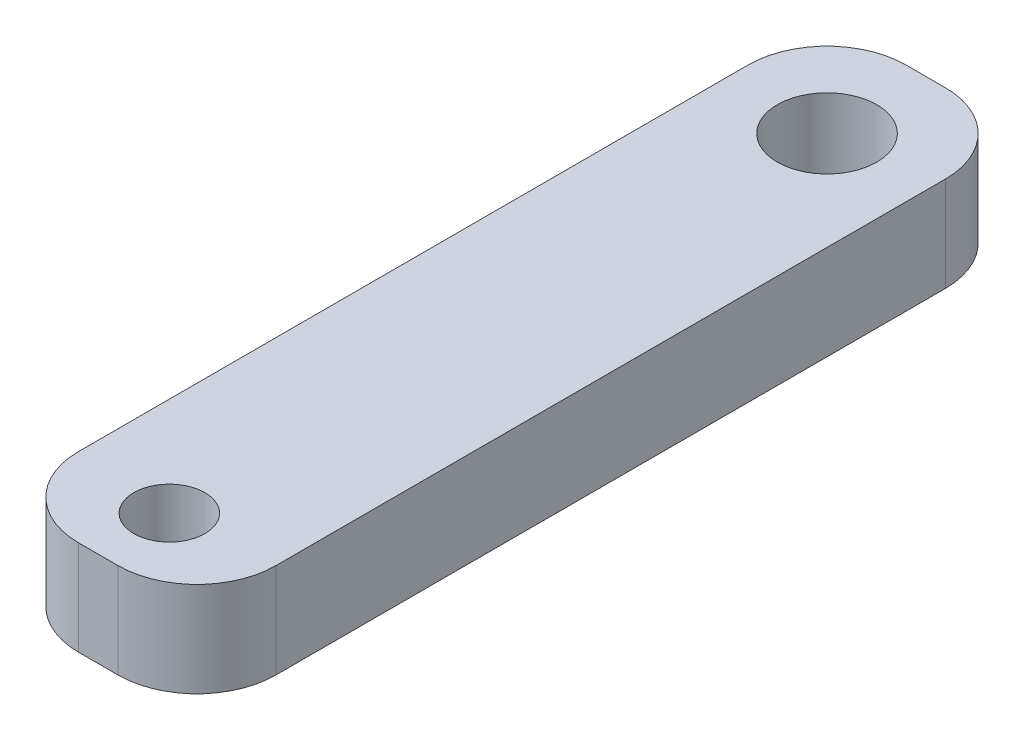
ISO-10303-21;
HEADER;
FILE_DESCRIPTION(('STEP AP214'),'2;1');
FILE_NAME('part.step','',(''),(''),'','','');
FILE_SCHEMA(('AUTOMOTIVE_DESIGN { 1 0 10303 214 1 1 1 1 }'));
ENDSEC;
DATA;
#1=APPLICATION_CONTEXT('core data for automotive mechanical design processes');
#2=APPLICATION_PROTOCOL_DEFINITION('international standard','automotive_design',2000,#1);
#3=PRODUCT_CONTEXT('',#1,'mechanical');
#4=PRODUCT('Part','Part','',(#3));
#5=PRODUCT_RELATED_PRODUCT_CATEGORY('part','',(#4));
#6=PRODUCT_DEFINITION_FORMATION('','',#4);
#7=PRODUCT_DEFINITION_CONTEXT('part definition',#1,'design');
#8=PRODUCT_DEFINITION('design','',#6,#7);
#9=PRODUCT_DEFINITION_SHAPE('','',#8);
#10=(LENGTH_UNIT() NAMED_UNIT(*) SI_UNIT(.MILLI.,.METRE.));
#11=(NAMED_UNIT(*) PLANE_ANGLE_UNIT() SI_UNIT($,.RADIAN.));
#12=(NAMED_UNIT(*) SI_UNIT($,.STERADIAN.) SOLID_ANGLE_UNIT());
#13=UNCERTAINTY_MEASURE_WITH_UNIT(LENGTH_MEASURE(1.E-05),#10,'distance_accuracy_value','');
#14=(GEOMETRIC_REPRESENTATION_CONTEXT(3) GLOBAL_UNCERTAINTY_ASSIGNED_CONTEXT((#13)) GLOBAL_UNIT_ASSIGNED_CONTEXT((#10,
#11,#12)) REPRESENTATION_CONTEXT('',''));
#15=CARTESIAN_POINT('',(0.,0.,0.));
#16=DIRECTION('',(0.,0.,1.));
#17=DIRECTION('',(1.,0.,0.));
#18=AXIS2_PLACEMENT_3D('',#15,#16,#17);
#19=CARTESIAN_POINT('',(143.707898145163,84.0030258628715,176.598461023065));
#20=DIRECTION('',(0.,1.,0.));
#21=DIRECTION('',(0.,0.,1.));
#22=AXIS2_PLACEMENT_3D('',#19,#20,#21);
#23=PLANE('',#22);
#24=CARTESIAN_POINT('',(143.072898145163,84.0030258628715,155.70030058551));
#25=DIRECTION('',(0.,1.,0.));
#26=DIRECTION('',(0.,0.,1.));
#27=AXIS2_PLACEMENT_3D('',#24,#25,#26);
#28=CIRCLE('',#27,1.59999999999999);
#29=CARTESIAN_POINT('',(143.072898145163,84.0030258628715,157.30030058551));
#30=VERTEX_POINT('',#29);
#31=EDGE_CURVE('E152',#30,#30,#28,.T.);
#32=ORIENTED_EDGE('',*,*,#31,.F.);
#33=EDGE_LOOP('',(#32));
#34=FACE_BOUND('',#33,.T.);
#35=CARTESIAN_POINT('',(143.707898145163,84.0030258628715,176.598461023065));
#36=DIRECTION('',(0.,1.,0.));
#37=DIRECTION('',(0.,0.,1.));
#38=AXIS2_PLACEMENT_3D('',#35,#36,#37);
#39=CIRCLE('',#38,2.53999999999999);
#40=CARTESIAN_POINT('',(143.707898145163,84.0030258628715,179.138461023065));
#41=VERTEX_POINT('',#40);
#42=CARTESIAN_POINT('',(146.247898145163,84.0030258628715,176.598461023065));
#43=VERTEX_POINT('',#42);
#44=EDGE_CURVE('E170',#41,#43,#39,.T.);
#45=ORIENTED_EDGE('',*,*,#44,.T.);
#46=DIRECTION('',(0.,0.,-1.));
#47=VECTOR('',#46,1.);
#48=CARTESIAN_POINT('',(146.247898145163,84.0030258628715,155.06530058551));
#49=LINE('',#48,#47);
#50=CARTESIAN_POINT('',(146.247898145163,84.0030258628715,155.06530058551));
#51=VERTEX_POINT('',#50);
#52=EDGE_CURVE('E106',#43,#51,#49,.T.);
#53=ORIENTED_EDGE('',*,*,#52,.T.);
#54=CARTESIAN_POINT('',(143.707898145163,84.0030258628715,155.06530058551));
#55=DIRECTION('',(0.,1.,0.));
#56=DIRECTION('',(0.,0.,-1.));
#57=AXIS2_PLACEMENT_3D('',#54,#55,#56);
#58=CIRCLE('',#57,2.53999999999999);
#59=CARTESIAN_POINT('',(143.707898145163,84.0030258628715,152.52530058551));
#60=VERTEX_POINT('',#59);
#61=EDGE_CURVE('E191',#51,#60,#58,.T.);
#62=ORIENTED_EDGE('',*,*,#61,.T.);
#63=DIRECTION('',(-1.,0.,0.));
#64=VECTOR('',#63,1.);
#65=CARTESIAN_POINT('',(142.437898145163,84.0030258628715,152.52530058551));
#66=LINE('',#65,#64);
#67=CARTESIAN_POINT('',(142.437898145163,84.0030258628715,152.52530058551));
#68=VERTEX_POINT('',#67);
#69=EDGE_CURVE('E205',#60,#68,#66,.T.);
#70=ORIENTED_EDGE('',*,*,#69,.T.);
#71=CARTESIAN_POINT('',(142.437898145163,84.0030258628715,155.06530058551));
#72=DIRECTION('',(0.,1.,0.));
#73=DIRECTION('',(0.,0.,1.));
#74=AXIS2_PLACEMENT_3D('',#71,#72,#73);
#75=CIRCLE('',#74,2.53999999999999);
#76=CARTESIAN_POINT('',(139.897898145163,84.0030258628715,155.06530058551));
#77=VERTEX_POINT('',#76);
#78=EDGE_CURVE('E125',#68,#77,#75,.T.);
#79=ORIENTED_EDGE('',*,*,#78,.T.);
#80=DIRECTION('',(0.,0.,1.));
#81=VECTOR('',#80,1.);
#82=CARTESIAN_POINT('',(139.897898145163,84.0030258628715,155.06530058551));
#83=LINE('',#82,#81);
#84=CARTESIAN_POINT('',(139.897898145163,84.0030258628715,176.598461023065));
#85=VERTEX_POINT('',#84);
#86=EDGE_CURVE('E119',#77,#85,#83,.T.);
#87=ORIENTED_EDGE('',*,*,#86,.T.);
#88=CARTESIAN_POINT('',(142.437898145163,84.0030258628715,176.598461023065));
#89=DIRECTION('',(0.,1.,0.));
#90=DIRECTION('',(0.,0.,1.));
#91=AXIS2_PLACEMENT_3D('',#88,#89,#90);
#92=CIRCLE('',#91,2.53999999999999);
#93=CARTESIAN_POINT('',(142.437898145163,84.0030258628715,179.138461023065));
#94=VERTEX_POINT('',#93);
#95=EDGE_CURVE('E123',#85,#94,#92,.T.);
#96=ORIENTED_EDGE('',*,*,#95,.T.);
#97=DIRECTION('',(1.,0.,0.));
#98=VECTOR('',#97,1.);
#99=CARTESIAN_POINT('',(142.437898145163,84.0030258628715,179.138461023065));
#100=LINE('',#99,#98);
#101=EDGE_CURVE('E63',#94,#41,#100,.T.);
#102=ORIENTED_EDGE('',*,*,#101,.T.);
#103=EDGE_LOOP('',(#45,#53,#62,#70,#79,#87,#96,#102));
#104=FACE_BOUND('',#103,.T.);
#105=CARTESIAN_POINT('',(143.072898145163,84.0030258628715,176.852461023065));
#106=DIRECTION('',(0.,1.,0.));
#107=DIRECTION('',(0.,0.,1.));
#108=AXIS2_PLACEMENT_3D('',#105,#106,#107);
#109=CIRCLE('',#108,1.14300000000002);
#110=CARTESIAN_POINT('',(143.072898145163,84.0030258628715,177.995461023065));
#111=VERTEX_POINT('',#110);
#112=EDGE_CURVE('E219',#111,#111,#109,.T.);
#113=ORIENTED_EDGE('',*,*,#112,.F.);
#114=EDGE_LOOP('',(#113));
#115=FACE_BOUND('',#114,.T.);
#116=ADVANCED_FACE('F45',(#34,#104,#115),#23,.T.);
#117=CARTESIAN_POINT('',(143.707898145163,80.9550258628715,176.598461023065));
#118=DIRECTION('',(0.,1.,0.));
#119=DIRECTION('',(0.,0.,1.));
#120=AXIS2_PLACEMENT_3D('',#117,#118,#119);
#121=PLANE('',#120);
#122=CARTESIAN_POINT('',(143.707898145163,80.9550258628715,176.598461023065));
#123=DIRECTION('',(0.,1.,0.));
#124=DIRECTION('',(0.,0.,1.));
#125=AXIS2_PLACEMENT_3D('',#122,#123,#124);
#126=CIRCLE('',#125,2.53999999999999);
#127=CARTESIAN_POINT('',(143.707898145163,80.9550258628715,179.138461023065));
#128=VERTEX_POINT('',#127);
#129=CARTESIAN_POINT('',(146.247898145163,80.9550258628715,176.598461023065));
#130=VERTEX_POINT('',#129);
#131=EDGE_CURVE('E147',#128,#130,#126,.T.);
#132=ORIENTED_EDGE('',*,*,#131,.F.);
#133=DIRECTION('',(1.,0.,0.));
#134=VECTOR('',#133,1.);
#135=CARTESIAN_POINT('',(142.437898145163,80.9550258628715,179.138461023065));
#136=LINE('',#135,#134);
#137=CARTESIAN_POINT('',(142.437898145163,80.9550258628715,179.138461023065));
#138=VERTEX_POINT('',#137);
#139=EDGE_CURVE('E98',#138,#128,#136,.T.);
#140=ORIENTED_EDGE('',*,*,#139,.F.);
#141=CARTESIAN_POINT('',(142.437898145163,80.9550258628715,176.598461023065));
#142=DIRECTION('',(0.,1.,0.));
#143=DIRECTION('',(0.,0.,1.));
#144=AXIS2_PLACEMENT_3D('',#141,#142,#143);
#145=CIRCLE('',#144,2.53999999999999);
#146=CARTESIAN_POINT('',(139.897898145163,80.9550258628715,176.598461023065));
#147=VERTEX_POINT('',#146);
#148=EDGE_CURVE('E92',#147,#138,#145,.T.);
#149=ORIENTED_EDGE('',*,*,#148,.F.);
#150=DIRECTION('',(0.,0.,1.));
#151=VECTOR('',#150,1.);
#152=CARTESIAN_POINT('',(139.897898145163,80.9550258628715,155.06530058551));
#153=LINE('',#152,#151);
#154=CARTESIAN_POINT('',(139.897898145163,80.9550258628715,155.06530058551));
#155=VERTEX_POINT('',#154);
#156=EDGE_CURVE('E134',#155,#147,#153,.T.);
#157=ORIENTED_EDGE('',*,*,#156,.F.);
#158=CARTESIAN_POINT('',(142.437898145163,80.9550258628715,155.06530058551));
#159=DIRECTION('',(0.,1.,0.));
#160=DIRECTION('',(0.,0.,1.));
#161=AXIS2_PLACEMENT_3D('',#158,#159,#160);
#162=CIRCLE('',#161,2.53999999999999);
#163=CARTESIAN_POINT('',(142.437898145163,80.9550258628715,152.52530058551));
#164=VERTEX_POINT('',#163);
#165=EDGE_CURVE('E161',#164,#155,#162,.T.);
#166=ORIENTED_EDGE('',*,*,#165,.F.);
#167=DIRECTION('',(-1.,0.,0.));
#168=VECTOR('',#167,1.);
#169=CARTESIAN_POINT('',(142.437898145163,80.9550258628715,152.52530058551));
#170=LINE('',#169,#168);
#171=CARTESIAN_POINT('',(143.707898145163,80.9550258628715,152.52530058551));
#172=VERTEX_POINT('',#171);
#173=EDGE_CURVE('E158',#172,#164,#170,.T.);
#174=ORIENTED_EDGE('',*,*,#173,.F.);
#175=CARTESIAN_POINT('',(143.707898145163,80.9550258628715,155.06530058551));
#176=DIRECTION('',(0.,1.,0.));
#177=DIRECTION('',(0.,0.,-1.));
#178=AXIS2_PLACEMENT_3D('',#175,#176,#177);
#179=CIRCLE('',#178,2.53999999999999);
#180=CARTESIAN_POINT('',(146.247898145163,80.9550258628715,155.06530058551));
#181=VERTEX_POINT('',#180);
#182=EDGE_CURVE('E155',#181,#172,#179,.T.);
#183=ORIENTED_EDGE('',*,*,#182,.F.);
#184=DIRECTION('',(0.,0.,-1.));
#185=VECTOR('',#184,1.);
#186=CARTESIAN_POINT('',(146.247898145163,80.9550258628715,155.06530058551));
#187=LINE('',#186,#185);
#188=EDGE_CURVE('E151',#130,#181,#187,.T.);
#189=ORIENTED_EDGE('',*,*,#188,.F.);
#190=EDGE_LOOP('',(#132,#140,#149,#157,#166,#174,#183,#189));
#191=FACE_BOUND('',#190,.T.);
#192=CARTESIAN_POINT('',(143.072898145163,80.9550258628715,155.70030058551));
#193=DIRECTION('',(0.,1.,0.));
#194=DIRECTION('',(0.,0.,1.));
#195=AXIS2_PLACEMENT_3D('',#192,#193,#194);
#196=CIRCLE('',#195,1.59999999999999);
#197=CARTESIAN_POINT('',(143.072898145163,80.9550258628715,157.30030058551));
#198=VERTEX_POINT('',#197);
#199=EDGE_CURVE('E215',#198,#198,#196,.T.);
#200=ORIENTED_EDGE('',*,*,#199,.T.);
#201=EDGE_LOOP('',(#200));
#202=FACE_BOUND('',#201,.T.);
#203=CARTESIAN_POINT('',(143.072898145163,80.9550258628715,176.852461023065));
#204=DIRECTION('',(0.,1.,0.));
#205=DIRECTION('',(0.,0.,1.));
#206=AXIS2_PLACEMENT_3D('',#203,#204,#205);
#207=CIRCLE('',#206,1.14300000000002);
#208=CARTESIAN_POINT('',(143.072898145163,80.9550258628715,177.995461023065));
#209=VERTEX_POINT('',#208);
#210=EDGE_CURVE('E223',#209,#209,#207,.T.);
#211=ORIENTED_EDGE('',*,*,#210,.T.);
#212=EDGE_LOOP('',(#211));
#213=FACE_BOUND('',#212,.T.);
#214=ADVANCED_FACE('F195',(#191,#202,#213),#121,.F.);
#215=CARTESIAN_POINT('',(143.707898145163,84.0030258628715,176.598461023065));
#216=DIRECTION('',(0.,-1.,0.));
#217=DIRECTION('',(0.,0.,-1.));
#218=AXIS2_PLACEMENT_3D('',#215,#216,#217);
#219=CYLINDRICAL_SURFACE('',#218,2.53999999999999);
#220=ORIENTED_EDGE('',*,*,#131,.T.);
#221=DIRECTION('',(0.,-1.,0.));
#222=VECTOR('',#221,1.);
#223=CARTESIAN_POINT('',(146.247898145163,84.0030258628715,176.598461023065));
#224=LINE('',#223,#222);
#225=EDGE_CURVE('E11',#43,#130,#224,.T.);
#226=ORIENTED_EDGE('',*,*,#225,.F.);
#227=ORIENTED_EDGE('',*,*,#44,.F.);
#228=DIRECTION('',(0.,-1.,0.));
#229=VECTOR('',#228,1.);
#230=CARTESIAN_POINT('',(143.707898145163,84.0030258628715,179.138461023065));
#231=LINE('',#230,#229);
#232=EDGE_CURVE('E143',#41,#128,#231,.T.);
#233=ORIENTED_EDGE('',*,*,#232,.T.);
#234=EDGE_LOOP('',(#220,#226,#227,#233));
#235=FACE_BOUND('',#234,.T.);
#236=ADVANCED_FACE('F47',(#235),#219,.T.);
#237=CARTESIAN_POINT('',(146.247898145163,84.0030258628715,155.06530058551));
#238=DIRECTION('',(-1.,0.,0.));
#239=DIRECTION('',(0.,0.,1.));
#240=AXIS2_PLACEMENT_3D('',#237,#238,#239);
#241=PLANE('',#240);
#242=ORIENTED_EDGE('',*,*,#188,.T.);
#243=DIRECTION('',(0.,-1.,0.));
#244=VECTOR('',#243,1.);
#245=CARTESIAN_POINT('',(146.247898145163,84.0030258628715,155.06530058551));
#246=LINE('',#245,#244);
#247=EDGE_CURVE('E55',#51,#181,#246,.T.);
#248=ORIENTED_EDGE('',*,*,#247,.F.);
#249=ORIENTED_EDGE('',*,*,#52,.F.);
#250=ORIENTED_EDGE('',*,*,#225,.T.);
#251=EDGE_LOOP('',(#242,#248,#249,#250));
#252=FACE_BOUND('',#251,.T.);
#253=ADVANCED_FACE('F257',(#252),#241,.F.);
#254=CARTESIAN_POINT('',(143.707898145163,84.0030258628715,155.06530058551));
#255=DIRECTION('',(0.,-1.,0.));
#256=DIRECTION('',(0.,0.,-1.));
#257=AXIS2_PLACEMENT_3D('',#254,#255,#256);
#258=CYLINDRICAL_SURFACE('',#257,2.53999999999999);
#259=ORIENTED_EDGE('',*,*,#182,.T.);
#260=DIRECTION('',(0.,-1.,0.));
#261=VECTOR('',#260,1.);
#262=CARTESIAN_POINT('',(143.707898145163,84.0030258628715,152.52530058551));
#263=LINE('',#262,#261);
#264=EDGE_CURVE('E181',#60,#172,#263,.T.);
#265=ORIENTED_EDGE('',*,*,#264,.F.);
#266=ORIENTED_EDGE('',*,*,#61,.F.);
#267=ORIENTED_EDGE('',*,*,#247,.T.);
#268=EDGE_LOOP('',(#259,#265,#266,#267));
#269=FACE_BOUND('',#268,.T.);
#270=ADVANCED_FACE('F189',(#269),#258,.T.);
#271=CARTESIAN_POINT('',(142.437898145163,84.0030258628715,152.52530058551));
#272=DIRECTION('',(0.,0.,1.));
#273=DIRECTION('',(1.,0.,0.));
#274=AXIS2_PLACEMENT_3D('',#271,#272,#273);
#275=PLANE('',#274);
#276=ORIENTED_EDGE('',*,*,#173,.T.);
#277=DIRECTION('',(0.,-1.,0.));
#278=VECTOR('',#277,1.);
#279=CARTESIAN_POINT('',(142.437898145163,84.0030258628715,152.52530058551));
#280=LINE('',#279,#278);
#281=EDGE_CURVE('E177',#68,#164,#280,.T.);
#282=ORIENTED_EDGE('',*,*,#281,.F.);
#283=ORIENTED_EDGE('',*,*,#69,.F.);
#284=ORIENTED_EDGE('',*,*,#264,.T.);
#285=EDGE_LOOP('',(#276,#282,#283,#284));
#286=FACE_BOUND('',#285,.T.);
#287=ADVANCED_FACE('F200',(#286),#275,.F.);
#288=CARTESIAN_POINT('',(142.437898145163,84.0030258628715,155.06530058551));
#289=DIRECTION('',(0.,-1.,0.));
#290=DIRECTION('',(0.,0.,-1.));
#291=AXIS2_PLACEMENT_3D('',#288,#289,#290);
#292=CYLINDRICAL_SURFACE('',#291,2.53999999999999);
#293=ORIENTED_EDGE('',*,*,#165,.T.);
#294=DIRECTION('',(0.,-1.,0.));
#295=VECTOR('',#294,1.);
#296=CARTESIAN_POINT('',(139.897898145163,84.0030258628715,155.06530058551));
#297=LINE('',#296,#295);
#298=EDGE_CURVE('E136',#77,#155,#297,.T.);
#299=ORIENTED_EDGE('',*,*,#298,.F.);
#300=ORIENTED_EDGE('',*,*,#78,.F.);
#301=ORIENTED_EDGE('',*,*,#281,.T.);
#302=EDGE_LOOP('',(#293,#299,#300,#301));
#303=FACE_BOUND('',#302,.T.);
#304=ADVANCED_FACE('F203',(#303),#292,.T.);
#305=CARTESIAN_POINT('',(139.897898145163,84.0030258628715,155.06530058551));
#306=DIRECTION('',(1.,0.,0.));
#307=DIRECTION('',(0.,0.,-1.));
#308=AXIS2_PLACEMENT_3D('',#305,#306,#307);
#309=PLANE('',#308);
#310=ORIENTED_EDGE('',*,*,#156,.T.);
#311=DIRECTION('',(0.,-1.,0.));
#312=VECTOR('',#311,1.);
#313=CARTESIAN_POINT('',(139.897898145163,84.0030258628715,176.598461023065));
#314=LINE('',#313,#312);
#315=EDGE_CURVE('E131',#85,#147,#314,.T.);
#316=ORIENTED_EDGE('',*,*,#315,.F.);
#317=ORIENTED_EDGE('',*,*,#86,.F.);
#318=ORIENTED_EDGE('',*,*,#298,.T.);
#319=EDGE_LOOP('',(#310,#316,#317,#318));
#320=FACE_BOUND('',#319,.T.);
#321=ADVANCED_FACE('F132',(#320),#309,.F.);
#322=CARTESIAN_POINT('',(142.437898145163,84.0030258628715,176.598461023065));
#323=DIRECTION('',(0.,-1.,0.));
#324=DIRECTION('',(0.,0.,-1.));
#325=AXIS2_PLACEMENT_3D('',#322,#323,#324);
#326=CYLINDRICAL_SURFACE('',#325,2.53999999999999);
#327=ORIENTED_EDGE('',*,*,#148,.T.);
#328=DIRECTION('',(0.,-1.,0.));
#329=VECTOR('',#328,1.);
#330=CARTESIAN_POINT('',(142.437898145163,84.0030258628715,179.138461023065));
#331=LINE('',#330,#329);
#332=EDGE_CURVE('E137',#94,#138,#331,.T.);
#333=ORIENTED_EDGE('',*,*,#332,.F.);
#334=ORIENTED_EDGE('',*,*,#95,.F.);
#335=ORIENTED_EDGE('',*,*,#315,.T.);
#336=EDGE_LOOP('',(#327,#333,#334,#335));
#337=FACE_BOUND('',#336,.T.);
#338=ADVANCED_FACE('F139',(#337),#326,.T.);
#339=CARTESIAN_POINT('',(142.437898145163,84.0030258628715,179.138461023065));
#340=DIRECTION('',(0.,0.,-1.));
#341=DIRECTION('',(-1.,0.,0.));
#342=AXIS2_PLACEMENT_3D('',#339,#340,#341);
#343=PLANE('',#342);
#344=ORIENTED_EDGE('',*,*,#139,.T.);
#345=ORIENTED_EDGE('',*,*,#232,.F.);
#346=ORIENTED_EDGE('',*,*,#101,.F.);
#347=ORIENTED_EDGE('',*,*,#332,.T.);
#348=EDGE_LOOP('',(#344,#345,#346,#347));
#349=FACE_BOUND('',#348,.T.);
#350=ADVANCED_FACE('F245',(#349),#343,.F.);
#351=CARTESIAN_POINT('',(143.072898145163,84.0030258628715,155.70030058551));
#352=DIRECTION('',(0.,-1.,0.));
#353=DIRECTION('',(0.,0.,-1.));
#354=AXIS2_PLACEMENT_3D('',#351,#352,#353);
#355=CYLINDRICAL_SURFACE('',#354,1.59999999999999);
#356=ORIENTED_EDGE('',*,*,#31,.T.);
#357=EDGE_LOOP('',(#356));
#358=FACE_BOUND('',#357,.T.);
#359=ORIENTED_EDGE('',*,*,#199,.F.);
#360=EDGE_LOOP('',(#359));
#361=FACE_BOUND('',#360,.T.);
#362=ADVANCED_FACE('F242',(#358,#361),#355,.F.);
#363=CARTESIAN_POINT('',(143.072898145163,84.0030258628715,176.852461023065));
#364=DIRECTION('',(0.,-1.,0.));
#365=DIRECTION('',(0.,0.,-1.));
#366=AXIS2_PLACEMENT_3D('',#363,#364,#365);
#367=CYLINDRICAL_SURFACE('',#366,1.14300000000002);
#368=ORIENTED_EDGE('',*,*,#112,.T.);
#369=EDGE_LOOP('',(#368));
#370=FACE_BOUND('',#369,.T.);
#371=ORIENTED_EDGE('',*,*,#210,.F.);
#372=EDGE_LOOP('',(#371));
#373=FACE_BOUND('',#372,.T.);
#374=ADVANCED_FACE('F231',(#370,#373),#367,.F.);
#375=CLOSED_SHELL('',(#116,#214,#236,#253,#270,#287,#304,#321,#338,#350,#362,#374));
#376=MANIFOLD_SOLID_BREP('B2',#375);
#377=ADVANCED_BREP_SHAPE_REPRESENTATION('',(#18,#376),#14);
#378=SHAPE_DEFINITION_REPRESENTATION(#9,#377);
ENDSEC;
END-ISO-10303-21;
